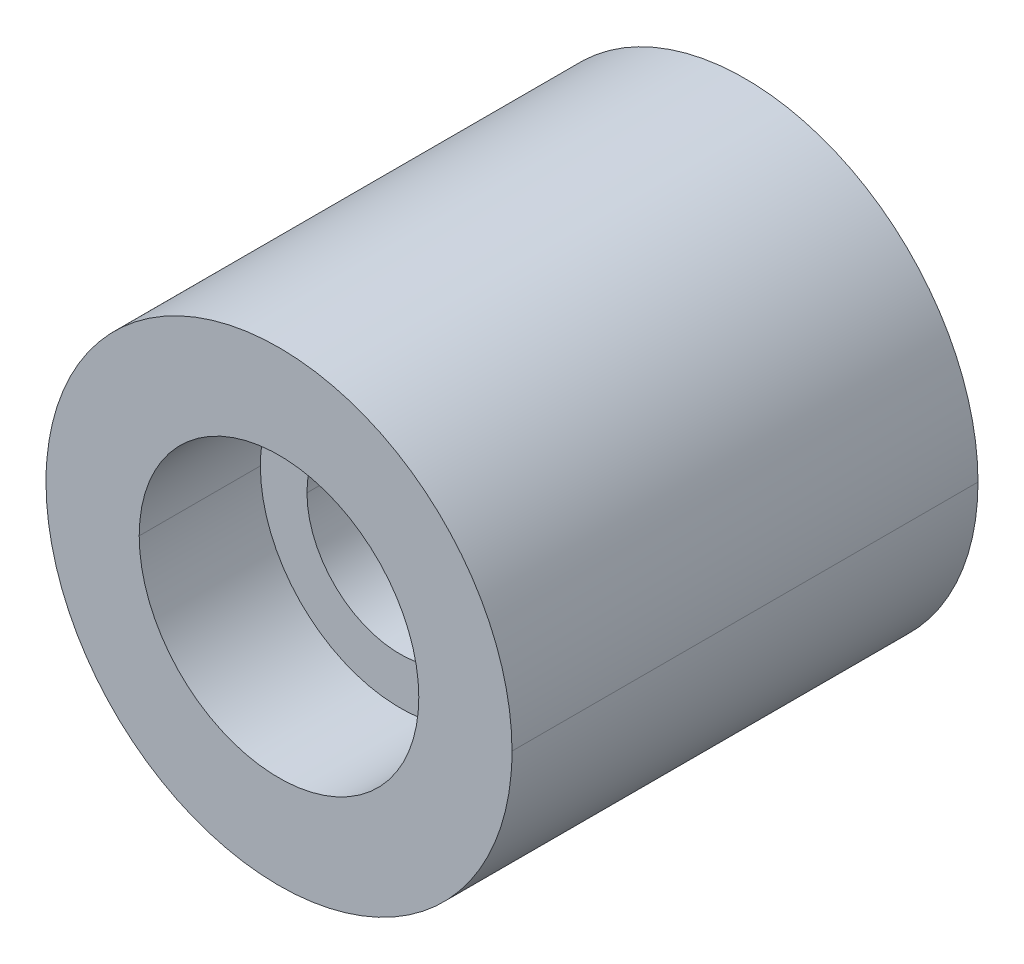
ISO-10303-21;
HEADER;
FILE_DESCRIPTION(('STEP AP214'),'2;1');
FILE_NAME('part.step','',(''),(''),'','','');
FILE_SCHEMA(('AUTOMOTIVE_DESIGN { 1 0 10303 214 1 1 1 1 }'));
ENDSEC;
DATA;
#1=APPLICATION_CONTEXT('core data for automotive mechanical design processes');
#2=APPLICATION_PROTOCOL_DEFINITION('international standard','automotive_design',2000,#1);
#3=PRODUCT_CONTEXT('',#1,'mechanical');
#4=PRODUCT('Part','Part','',(#3));
#5=PRODUCT_RELATED_PRODUCT_CATEGORY('part','',(#4));
#6=PRODUCT_DEFINITION_FORMATION('','',#4);
#7=PRODUCT_DEFINITION_CONTEXT('part definition',#1,'design');
#8=PRODUCT_DEFINITION('design','',#6,#7);
#9=PRODUCT_DEFINITION_SHAPE('','',#8);
#10=(LENGTH_UNIT() NAMED_UNIT(*) SI_UNIT(.MILLI.,.METRE.));
#11=(NAMED_UNIT(*) PLANE_ANGLE_UNIT() SI_UNIT($,.RADIAN.));
#12=(NAMED_UNIT(*) SI_UNIT($,.STERADIAN.) SOLID_ANGLE_UNIT());
#13=UNCERTAINTY_MEASURE_WITH_UNIT(LENGTH_MEASURE(1.E-05),#10,'distance_accuracy_value','');
#14=(GEOMETRIC_REPRESENTATION_CONTEXT(3) GLOBAL_UNCERTAINTY_ASSIGNED_CONTEXT((#13)) GLOBAL_UNIT_ASSIGNED_CONTEXT((#10,
#11,#12)) REPRESENTATION_CONTEXT('',''));
#15=CARTESIAN_POINT('',(0.,0.,0.));
#16=DIRECTION('',(0.,0.,1.));
#17=DIRECTION('',(1.,0.,0.));
#18=AXIS2_PLACEMENT_3D('',#15,#16,#17);
#19=CARTESIAN_POINT('',(-2.5,0.,-5.));
#20=DIRECTION('',(0.,0.,1.));
#21=DIRECTION('',(1.,0.,0.));
#22=AXIS2_PLACEMENT_3D('',#19,#20,#21);
#23=PLANE('',#22);
#24=CARTESIAN_POINT('',(0.,0.,-5.));
#25=DIRECTION('',(0.,0.,1.));
#26=DIRECTION('',(1.,0.,0.));
#27=AXIS2_PLACEMENT_3D('',#24,#25,#26);
#28=CIRCLE('',#27,1.);
#29=CARTESIAN_POINT('',(1.,0.,-5.));
#30=VERTEX_POINT('',#29);
#31=CARTESIAN_POINT('',(-1.,0.,-5.));
#32=VERTEX_POINT('',#31);
#33=EDGE_CURVE('E106',#30,#32,#28,.T.);
#34=ORIENTED_EDGE('',*,*,#33,.T.);
#35=CARTESIAN_POINT('',(0.,0.,-5.));
#36=DIRECTION('',(0.,0.,1.));
#37=DIRECTION('',(1.,0.,0.));
#38=AXIS2_PLACEMENT_3D('',#35,#36,#37);
#39=CIRCLE('',#38,1.);
#40=EDGE_CURVE('E103',#32,#30,#39,.T.);
#41=ORIENTED_EDGE('',*,*,#40,.T.);
#42=EDGE_LOOP('',(#34,#41));
#43=FACE_BOUND('',#42,.T.);
#44=CARTESIAN_POINT('',(0.,0.,-5.));
#45=DIRECTION('',(0.,0.,1.));
#46=DIRECTION('',(1.,0.,0.));
#47=AXIS2_PLACEMENT_3D('',#44,#45,#46);
#48=CIRCLE('',#47,2.5);
#49=CARTESIAN_POINT('',(2.5,0.,-5.));
#50=VERTEX_POINT('',#49);
#51=CARTESIAN_POINT('',(-2.5,0.,-5.));
#52=VERTEX_POINT('',#51);
#53=EDGE_CURVE('E111',#50,#52,#48,.T.);
#54=ORIENTED_EDGE('',*,*,#53,.F.);
#55=CARTESIAN_POINT('',(0.,0.,-5.));
#56=DIRECTION('',(0.,0.,1.));
#57=DIRECTION('',(1.,0.,0.));
#58=AXIS2_PLACEMENT_3D('',#55,#56,#57);
#59=CIRCLE('',#58,2.5);
#60=EDGE_CURVE('E11',#52,#50,#59,.T.);
#61=ORIENTED_EDGE('',*,*,#60,.F.);
#62=EDGE_LOOP('',(#54,#61));
#63=FACE_BOUND('',#62,.T.);
#64=ADVANCED_FACE('F17',(#43,#63),#23,.F.);
#65=CARTESIAN_POINT('',(0.,0.,0.));
#66=DIRECTION('',(0.,0.,1.));
#67=DIRECTION('',(1.,0.,0.));
#68=AXIS2_PLACEMENT_3D('',#65,#66,#67);
#69=CYLINDRICAL_SURFACE('',#68,2.5);
#70=DIRECTION('',(0.,0.,1.));
#71=VECTOR('',#70,1.);
#72=CARTESIAN_POINT('',(-2.5,0.,0.));
#73=LINE('',#72,#71);
#74=CARTESIAN_POINT('',(-2.5,0.,0.));
#75=VERTEX_POINT('',#74);
#76=EDGE_CURVE('E181',#52,#75,#73,.T.);
#77=ORIENTED_EDGE('',*,*,#76,.F.);
#78=ORIENTED_EDGE('',*,*,#60,.T.);
#79=DIRECTION('',(0.,0.,1.));
#80=VECTOR('',#79,1.);
#81=CARTESIAN_POINT('',(2.5,0.,0.));
#82=LINE('',#81,#80);
#83=CARTESIAN_POINT('',(2.5,0.,0.));
#84=VERTEX_POINT('',#83);
#85=EDGE_CURVE('E28',#50,#84,#82,.T.);
#86=ORIENTED_EDGE('',*,*,#85,.T.);
#87=CARTESIAN_POINT('',(-2.5,0.,0.));
#88=CARTESIAN_POINT('',(-2.5,-0.232376993469,0.));
#89=CARTESIAN_POINT('',(-2.47300046646,-0.464753605108,0.));
#90=CARTESIAN_POINT('',(-2.41899536913,-0.692956947242,0.));
#91=CARTESIAN_POINT('',(-2.25896066501,-1.13261792039,0.));
#92=CARTESIAN_POINT('',(-2.00238386705,-1.52387206404,0.));
#93=CARTESIAN_POINT('',(-1.85182487192,-1.70366445395,0.));
#94=CARTESIAN_POINT('',(-1.51170614134,-2.02496201984,0.));
#95=CARTESIAN_POINT('',(-1.10698178651,-2.25971647378,0.));
#96=CARTESIAN_POINT('',(-0.891808454339,-2.35295678054,0.));
#97=CARTESIAN_POINT('',(-0.443758447734,-2.48773091022,0.));
#98=CARTESIAN_POINT('',(0.0232552840508,-2.51618489225,0.));
#99=CARTESIAN_POINT('',(0.257396106103,-2.50309312107,0.));
#100=CARTESIAN_POINT('',(0.718328113524,-2.42275284772,0.));
#101=CARTESIAN_POINT('',(1.14855898515,-2.23887013383,0.));
#102=CARTESIAN_POINT('',(1.35199668373,-2.12222357361,0.));
#103=CARTESIAN_POINT('',(1.72802863007,-1.84381227246,0.));
#104=CARTESIAN_POINT('',(2.03020751425,-1.48660171889,0.));
#105=CARTESIAN_POINT('',(2.15978483864,-1.29114576084,0.));
#106=CARTESIAN_POINT('',(2.34574356163,-0.923892079527,0.));
#107=CARTESIAN_POINT('',(2.4532587915,-0.527734590024,0.));
#108=CARTESIAN_POINT('',(2.48442002643,-0.353043827519,0.));
#109=CARTESIAN_POINT('',(2.5,-0.176521803592,0.));
#110=CARTESIAN_POINT('',(2.5,0.,0.));
#111=(BOUNDED_CURVE() B_SPLINE_CURVE(5,(#87,#88,#89,#90,#91,#92,#93,#94,#95,#96,#97,#98,#99,
#100,#101,#102,#103,#104,#105,#106,#107,#108,#109,#110),.UNSPECIFIED.,.F.,
.F.) B_SPLINE_CURVE_WITH_KNOTS((6,3,3,3,3,3,3,6),(0.,1.64315347874,3.2863069603,4.92946043079,
6.57261389546,8.21576737015,9.85892085167,11.1071184951),
.UNSPECIFIED.) CURVE() GEOMETRIC_REPRESENTATION_ITEM() RATIONAL_B_SPLINE_CURVE((1.,1.,1.,1.,1.,
1.,1.,1.,1.,1.,1.,1.,1.,1.,1.,1.,1.,1.,1.,1.,1.,1.,1.,1.)) REPRESENTATION_ITEM(''));
#112=EDGE_CURVE('E132',#75,#84,#111,.T.);
#113=ORIENTED_EDGE('',*,*,#112,.F.);
#114=EDGE_LOOP('',(#77,#78,#86,#113));
#115=FACE_BOUND('',#114,.T.);
#116=ADVANCED_FACE('F264',(#115),#69,.T.);
#117=CARTESIAN_POINT('',(0.,0.,0.));
#118=DIRECTION('',(0.,0.,1.));
#119=DIRECTION('',(1.,0.,0.));
#120=AXIS2_PLACEMENT_3D('',#117,#118,#119);
#121=CYLINDRICAL_SURFACE('',#120,2.5);
#122=ORIENTED_EDGE('',*,*,#53,.T.);
#123=ORIENTED_EDGE('',*,*,#76,.T.);
#124=CARTESIAN_POINT('',(2.5,0.,0.));
#125=CARTESIAN_POINT('',(2.5,0.23237699347,0.));
#126=CARTESIAN_POINT('',(2.47300046646,0.464753605108,0.));
#127=CARTESIAN_POINT('',(2.41899536913,0.692956947241,0.));
#128=CARTESIAN_POINT('',(2.25896066501,1.13261792039,0.));
#129=CARTESIAN_POINT('',(2.00238386705,1.52387206404,0.));
#130=CARTESIAN_POINT('',(1.85182487192,1.70366445395,0.));
#131=CARTESIAN_POINT('',(1.51170614134,2.02496201984,0.));
#132=CARTESIAN_POINT('',(1.10698178651,2.25971647378,0.));
#133=CARTESIAN_POINT('',(0.891808454339,2.35295678054,0.));
#134=CARTESIAN_POINT('',(0.443758447735,2.48773091022,0.));
#135=CARTESIAN_POINT('',(-0.0232552840495,2.51618489225,0.));
#136=CARTESIAN_POINT('',(-0.257396106105,2.50309312107,0.));
#137=CARTESIAN_POINT('',(-0.718328113523,2.42275284771,0.));
#138=CARTESIAN_POINT('',(-1.14855898514,2.23887013383,0.));
#139=CARTESIAN_POINT('',(-1.35199668374,2.12222357361,0.));
#140=CARTESIAN_POINT('',(-1.72802863007,1.84381227246,0.));
#141=CARTESIAN_POINT('',(-2.03020751425,1.48660171889,0.));
#142=CARTESIAN_POINT('',(-2.15978483864,1.29114576084,0.));
#143=CARTESIAN_POINT('',(-2.34574356163,0.923892079526,0.));
#144=CARTESIAN_POINT('',(-2.4532587915,0.527734590023,0.));
#145=CARTESIAN_POINT('',(-2.48442002643,0.35304382752,0.));
#146=CARTESIAN_POINT('',(-2.5,0.176521803593,0.));
#147=CARTESIAN_POINT('',(-2.5,0.,0.));
#148=(BOUNDED_CURVE() B_SPLINE_CURVE(5,(#124,#125,#126,#127,#128,#129,#130,#131,#132,#133,#134,
#135,#136,#137,#138,#139,#140,#141,#142,#143,#144,#145,#146,#147),.UNSPECIFIED.,.F.,
.F.) B_SPLINE_CURVE_WITH_KNOTS((6,3,3,3,3,3,3,6),(0.,1.64315347874,3.28630696031,4.9294604308,
6.57261389546,8.21576737014,9.85892085166,11.1071184951),
.UNSPECIFIED.) CURVE() GEOMETRIC_REPRESENTATION_ITEM() RATIONAL_B_SPLINE_CURVE((1.,1.,1.,1.,1.,
1.,1.,1.,1.,1.,1.,1.,1.,1.,1.,1.,1.,1.,1.,1.,1.,1.,1.,1.)) REPRESENTATION_ITEM(''));
#149=EDGE_CURVE('E161',#84,#75,#148,.T.);
#150=ORIENTED_EDGE('',*,*,#149,.F.);
#151=ORIENTED_EDGE('',*,*,#85,.F.);
#152=EDGE_LOOP('',(#122,#123,#150,#151));
#153=FACE_BOUND('',#152,.T.);
#154=ADVANCED_FACE('F262',(#153),#121,.T.);
#155=CARTESIAN_POINT('',(0.,0.,0.));
#156=DIRECTION('',(0.,0.,1.));
#157=DIRECTION('',(1.,0.,0.));
#158=AXIS2_PLACEMENT_3D('',#155,#156,#157);
#159=CYLINDRICAL_SURFACE('',#158,1.);
#160=ORIENTED_EDGE('',*,*,#40,.F.);
#161=DIRECTION('',(0.,0.,1.));
#162=VECTOR('',#161,1.);
#163=CARTESIAN_POINT('',(-1.,0.,0.));
#164=LINE('',#163,#162);
#165=CARTESIAN_POINT('',(-1.,0.,-4.5));
#166=VERTEX_POINT('',#165);
#167=EDGE_CURVE('E125',#32,#166,#164,.T.);
#168=ORIENTED_EDGE('',*,*,#167,.T.);
#169=CARTESIAN_POINT('',(-1.,0.,-4.5));
#170=CARTESIAN_POINT('',(-1.,-0.0979785568149,-4.5));
#171=CARTESIAN_POINT('',(-0.988000253016,-0.195956689375,-4.5));
#172=CARTESIAN_POINT('',(-0.963997580109,-0.29198034652,-4.5));
#173=CARTESIAN_POINT('',(-0.892969030651,-0.476182526371,-4.5));
#174=CARTESIAN_POINT('',(-0.779587891189,-0.637797965008,-4.5));
#175=CARTESIAN_POINT('',(-0.713225814277,-0.711233291885,-4.5));
#176=CARTESIAN_POINT('',(-0.563877854178,-0.840348293241,-4.5));
#177=CARTESIAN_POINT('',(-0.387786650424,-0.929604775489,-4.5));
#178=CARTESIAN_POINT('',(-0.294676065443,-0.963176969096,-4.5));
#179=CARTESIAN_POINT('',(-0.10214104395,-1.00683200961,-4.5));
#180=CARTESIAN_POINT('',(0.0952368426436,-1.00273299981,-4.5));
#181=CARTESIAN_POINT('',(0.193192755745,-0.98854459464,-4.5));
#182=CARTESIAN_POINT('',(0.38362324251,-0.936470338779,-4.5));
#183=CARTESIAN_POINT('',(0.555856987942,-0.839980078754,-4.5));
#184=CARTESIAN_POINT('',(0.635615255516,-0.78136873771,-4.5));
#185=CARTESIAN_POINT('',(0.779144673579,-0.645815039948,-4.5));
#186=CARTESIAN_POINT('',(0.885718312667,-0.479631727956,-4.5));
#187=CARTESIAN_POINT('',(0.928516747925,-0.390385074428,-4.5));
#188=CARTESIAN_POINT('',(0.972911898439,-0.25822255235,-4.5));
#189=CARTESIAN_POINT('',(0.993856533221,-0.121253382943,-4.5));
#190=CARTESIAN_POINT('',(0.997959135699,-0.0808132256003,-4.5));
#191=CARTESIAN_POINT('',(1.,-0.0404065767224,-4.5));
#192=CARTESIAN_POINT('',(1.,0.,-4.5));
#193=(BOUNDED_CURVE() B_SPLINE_CURVE(5,(#169,#170,#171,#172,#173,#174,#175,#176,#177,#178,#179,
#180,#181,#182,#183,#184,#185,#186,#187,#188,#189,#190,#191,#192),.UNSPECIFIED.,.F.,
.F.) B_SPLINE_CURVE_WITH_KNOTS((6,3,3,3,3,3,3,6),(0.,0.692813019347,1.38562602559,2.07843902508,
2.77125203691,3.46406506001,4.15687807886,4.44259572291),
.UNSPECIFIED.) CURVE() GEOMETRIC_REPRESENTATION_ITEM() RATIONAL_B_SPLINE_CURVE((1.,1.,1.,1.,1.,
1.,1.,1.,1.,1.,1.,1.,1.,1.,1.,1.,1.,1.,1.,1.,1.,1.,1.,1.)) REPRESENTATION_ITEM(''));
#194=CARTESIAN_POINT('',(1.,0.,-4.5));
#195=VERTEX_POINT('',#194);
#196=EDGE_CURVE('E118',#166,#195,#193,.T.);
#197=ORIENTED_EDGE('',*,*,#196,.T.);
#198=DIRECTION('',(0.,0.,1.));
#199=VECTOR('',#198,1.);
#200=CARTESIAN_POINT('',(1.,0.,0.));
#201=LINE('',#200,#199);
#202=EDGE_CURVE('E112',#30,#195,#201,.T.);
#203=ORIENTED_EDGE('',*,*,#202,.F.);
#204=EDGE_LOOP('',(#160,#168,#197,#203));
#205=FACE_BOUND('',#204,.T.);
#206=ADVANCED_FACE('F116',(#205),#159,.F.);
#207=CARTESIAN_POINT('',(0.,0.,0.));
#208=DIRECTION('',(0.,0.,1.));
#209=DIRECTION('',(1.,0.,0.));
#210=AXIS2_PLACEMENT_3D('',#207,#208,#209);
#211=CYLINDRICAL_SURFACE('',#210,1.);
#212=ORIENTED_EDGE('',*,*,#167,.F.);
#213=ORIENTED_EDGE('',*,*,#33,.F.);
#214=ORIENTED_EDGE('',*,*,#202,.T.);
#215=CARTESIAN_POINT('',(1.,0.,-4.5));
#216=CARTESIAN_POINT('',(1.,0.0979785568148,-4.5));
#217=CARTESIAN_POINT('',(0.988000253016,0.195956689375,-4.5));
#218=CARTESIAN_POINT('',(0.963997580109,0.29198034652,-4.5));
#219=CARTESIAN_POINT('',(0.892969030651,0.476182526371,-4.5));
#220=CARTESIAN_POINT('',(0.779587891188,0.637797965008,-4.5));
#221=CARTESIAN_POINT('',(0.713225814277,0.711233291885,-4.5));
#222=CARTESIAN_POINT('',(0.563877854178,0.840348293241,-4.5));
#223=CARTESIAN_POINT('',(0.387786650424,0.929604775489,-4.5));
#224=CARTESIAN_POINT('',(0.294676065443,0.963176969096,-4.5));
#225=CARTESIAN_POINT('',(0.10214104395,1.00683200961,-4.5));
#226=CARTESIAN_POINT('',(-0.0952368426438,1.00273299981,-4.5));
#227=CARTESIAN_POINT('',(-0.193192755745,0.98854459464,-4.5));
#228=CARTESIAN_POINT('',(-0.38362324251,0.936470338779,-4.5));
#229=CARTESIAN_POINT('',(-0.555856987942,0.839980078754,-4.5));
#230=CARTESIAN_POINT('',(-0.635615255516,0.78136873771,-4.5));
#231=CARTESIAN_POINT('',(-0.779144673579,0.645815039949,-4.5));
#232=CARTESIAN_POINT('',(-0.885718312666,0.479631727957,-4.5));
#233=CARTESIAN_POINT('',(-0.928516747925,0.390385074428,-4.5));
#234=CARTESIAN_POINT('',(-0.972911898439,0.25822255235,-4.5));
#235=CARTESIAN_POINT('',(-0.993856533221,0.121253382943,-4.5));
#236=CARTESIAN_POINT('',(-0.997959135699,0.0808132256003,-4.5));
#237=CARTESIAN_POINT('',(-1.,0.0404065767224,-4.5));
#238=CARTESIAN_POINT('',(-1.,0.,-4.5));
#239=(BOUNDED_CURVE() B_SPLINE_CURVE(5,(#215,#216,#217,#218,#219,#220,#221,#222,#223,#224,#225,
#226,#227,#228,#229,#230,#231,#232,#233,#234,#235,#236,#237,#238),.UNSPECIFIED.,.F.,
.F.) B_SPLINE_CURVE_WITH_KNOTS((6,3,3,3,3,3,3,6),(0.,0.692813019346,1.38562602559,2.07843902508,
2.77125203691,3.46406506001,4.15687807886,4.44259572291),
.UNSPECIFIED.) CURVE() GEOMETRIC_REPRESENTATION_ITEM() RATIONAL_B_SPLINE_CURVE((1.,1.,1.,1.,1.,
1.,1.,1.,1.,1.,1.,1.,1.,1.,1.,1.,1.,1.,1.,1.,1.,1.,1.,1.)) REPRESENTATION_ITEM(''));
#240=EDGE_CURVE('E151',#195,#166,#239,.T.);
#241=ORIENTED_EDGE('',*,*,#240,.T.);
#242=EDGE_LOOP('',(#212,#213,#214,#241));
#243=FACE_BOUND('',#242,.T.);
#244=ADVANCED_FACE('F124',(#243),#211,.F.);
#245=CARTESIAN_POINT('',(-1.5,0.,0.));
#246=DIRECTION('',(0.,0.,-1.));
#247=DIRECTION('',(0.,-1.,0.));
#248=AXIS2_PLACEMENT_3D('',#245,#246,#247);
#249=PLANE('',#248);
#250=CARTESIAN_POINT('',(0.,0.,0.));
#251=DIRECTION('',(0.,0.,1.));
#252=DIRECTION('',(1.,0.,0.));
#253=AXIS2_PLACEMENT_3D('',#250,#251,#252);
#254=CIRCLE('',#253,1.5);
#255=CARTESIAN_POINT('',(1.5,0.,0.));
#256=VERTEX_POINT('',#255);
#257=CARTESIAN_POINT('',(-1.5,0.,0.));
#258=VERTEX_POINT('',#257);
#259=EDGE_CURVE('E152',#256,#258,#254,.T.);
#260=ORIENTED_EDGE('',*,*,#259,.F.);
#261=CARTESIAN_POINT('',(0.,0.,0.));
#262=DIRECTION('',(0.,0.,1.));
#263=DIRECTION('',(1.,0.,0.));
#264=AXIS2_PLACEMENT_3D('',#261,#262,#263);
#265=CIRCLE('',#264,1.5);
#266=EDGE_CURVE('E148',#258,#256,#265,.T.);
#267=ORIENTED_EDGE('',*,*,#266,.F.);
#268=EDGE_LOOP('',(#260,#267));
#269=FACE_BOUND('',#268,.T.);
#270=ORIENTED_EDGE('',*,*,#149,.T.);
#271=ORIENTED_EDGE('',*,*,#112,.T.);
#272=EDGE_LOOP('',(#270,#271));
#273=FACE_BOUND('',#272,.T.);
#274=ADVANCED_FACE('F211',(#269,#273),#249,.F.);
#275=CARTESIAN_POINT('',(-2.,0.,-4.5));
#276=DIRECTION('',(0.,0.,-1.));
#277=DIRECTION('',(0.,-1.,0.));
#278=AXIS2_PLACEMENT_3D('',#275,#276,#277);
#279=PLANE('',#278);
#280=ORIENTED_EDGE('',*,*,#240,.F.);
#281=ORIENTED_EDGE('',*,*,#196,.F.);
#282=EDGE_LOOP('',(#280,#281));
#283=FACE_BOUND('',#282,.T.);
#284=CARTESIAN_POINT('',(0.,0.,-4.5));
#285=DIRECTION('',(0.,0.,1.));
#286=DIRECTION('',(1.,0.,0.));
#287=AXIS2_PLACEMENT_3D('',#284,#285,#286);
#288=CIRCLE('',#287,2.);
#289=CARTESIAN_POINT('',(2.,0.,-4.5));
#290=VERTEX_POINT('',#289);
#291=CARTESIAN_POINT('',(-2.,0.,-4.5));
#292=VERTEX_POINT('',#291);
#293=EDGE_CURVE('E136',#290,#292,#288,.T.);
#294=ORIENTED_EDGE('',*,*,#293,.T.);
#295=CARTESIAN_POINT('',(0.,0.,-4.5));
#296=DIRECTION('',(0.,0.,1.));
#297=DIRECTION('',(1.,0.,0.));
#298=AXIS2_PLACEMENT_3D('',#295,#296,#297);
#299=CIRCLE('',#298,2.);
#300=EDGE_CURVE('E177',#292,#290,#299,.T.);
#301=ORIENTED_EDGE('',*,*,#300,.T.);
#302=EDGE_LOOP('',(#294,#301));
#303=FACE_BOUND('',#302,.T.);
#304=ADVANCED_FACE('F209',(#283,#303),#279,.F.);
#305=CARTESIAN_POINT('',(0.,0.,0.));
#306=DIRECTION('',(0.,0.,1.));
#307=DIRECTION('',(1.,0.,0.));
#308=AXIS2_PLACEMENT_3D('',#305,#306,#307);
#309=CYLINDRICAL_SURFACE('',#308,1.5);
#310=CARTESIAN_POINT('',(-1.5,0.,-1.3));
#311=CARTESIAN_POINT('',(-1.5,-0.179995917201,-1.3));
#312=CARTESIAN_POINT('',(-1.47300122484,-0.359991198035,-1.3));
#313=CARTESIAN_POINT('',(-1.41898740997,-0.534604446808,-1.3));
#314=CARTESIAN_POINT('',(-1.2602861125,-0.86220889056,-1.3));
#315=CARTESIAN_POINT('',(-1.012454049,-1.12883261235,-1.3));
#316=CARTESIAN_POINT('',(-0.869280471064,-1.24244865057,-1.3));
#317=CARTESIAN_POINT('',(-0.553319256953,-1.42322277154,-1.3));
#318=CARTESIAN_POINT('',(-0.198227553453,-1.50334031601,-1.3));
#319=CARTESIAN_POINT('',(-0.0159088455457,-1.51626979686,-1.3));
#320=CARTESIAN_POINT('',(0.346937938243,-1.48706399517,-1.3));
#321=CARTESIAN_POINT('',(0.685245531009,-1.35268800301,-1.3));
#322=CARTESIAN_POINT('',(0.843020194458,-1.26041427264,-1.3));
#323=CARTESIAN_POINT('',(1.12599973072,-1.03143097888,-1.3));
#324=CARTESIAN_POINT('',(1.32934264252,-0.729502851114,-1.3));
#325=CARTESIAN_POINT('',(1.40745802191,-0.564259783279,-1.3));
#326=CARTESIAN_POINT('',(1.47188483428,-0.348738098805,-1.3));
#327=CARTESIAN_POINT('',(1.49548532329,-0.127397744905,-1.3));
#328=CARTESIAN_POINT('',(1.49849761926,-0.0849201598401,-1.3));
#329=CARTESIAN_POINT('',(1.5,-0.0424600622143,-1.3));
#330=CARTESIAN_POINT('',(1.5,0.,-1.3));
#331=(BOUNDED_CURVE() B_SPLINE_CURVE(5,(#310,#311,#312,#313,#314,#315,#316,#317,#318,#319,#320,
#321,#322,#323,#324,#325,#326,#327,#328,#329,#330),.UNSPECIFIED.,.F.,
.F.) B_SPLINE_CURVE_WITH_KNOTS((6,3,3,3,3,3,6),(0.,1.27276333639,2.54552668005,3.81828999931,
5.09105330297,6.3638166172,6.66405459642),
.UNSPECIFIED.) CURVE() GEOMETRIC_REPRESENTATION_ITEM() RATIONAL_B_SPLINE_CURVE((1.,1.,1.,1.,1.,
1.,1.,1.,1.,1.,1.,1.,1.,1.,1.,1.,1.,1.,1.,1.,1.)) REPRESENTATION_ITEM(''));
#332=CARTESIAN_POINT('',(-1.5,0.,-1.30000000075));
#333=VERTEX_POINT('',#332);
#334=CARTESIAN_POINT('',(1.5,0.,-1.30000000075));
#335=VERTEX_POINT('',#334);
#336=EDGE_CURVE('E142',#333,#335,#331,.T.);
#337=ORIENTED_EDGE('',*,*,#336,.F.);
#338=DIRECTION('',(0.,0.,1.));
#339=VECTOR('',#338,1.);
#340=CARTESIAN_POINT('',(-1.5,0.,0.));
#341=LINE('',#340,#339);
#342=EDGE_CURVE('E170',#333,#258,#341,.T.);
#343=ORIENTED_EDGE('',*,*,#342,.T.);
#344=ORIENTED_EDGE('',*,*,#266,.T.);
#345=DIRECTION('',(0.,0.,1.));
#346=VECTOR('',#345,1.);
#347=CARTESIAN_POINT('',(1.5,0.,0.));
#348=LINE('',#347,#346);
#349=EDGE_CURVE('E156',#335,#256,#348,.T.);
#350=ORIENTED_EDGE('',*,*,#349,.F.);
#351=EDGE_LOOP('',(#337,#343,#344,#350));
#352=FACE_BOUND('',#351,.T.);
#353=ADVANCED_FACE('F260',(#352),#309,.F.);
#354=CARTESIAN_POINT('',(0.,0.,0.));
#355=DIRECTION('',(0.,0.,1.));
#356=DIRECTION('',(1.,0.,0.));
#357=AXIS2_PLACEMENT_3D('',#354,#355,#356);
#358=CYLINDRICAL_SURFACE('',#357,1.5);
#359=ORIENTED_EDGE('',*,*,#342,.F.);
#360=CARTESIAN_POINT('',(1.5,0.,-1.3));
#361=CARTESIAN_POINT('',(1.5,0.179995917201,-1.3));
#362=CARTESIAN_POINT('',(1.47300122484,0.359991198035,-1.3));
#363=CARTESIAN_POINT('',(1.41898740997,0.534604446808,-1.3));
#364=CARTESIAN_POINT('',(1.2602861125,0.86220889056,-1.3));
#365=CARTESIAN_POINT('',(1.012454049,1.12883261235,-1.3));
#366=CARTESIAN_POINT('',(0.869280471064,1.24244865057,-1.3));
#367=CARTESIAN_POINT('',(0.553319256952,1.42322277154,-1.3));
#368=CARTESIAN_POINT('',(0.198227553451,1.50334031601,-1.3));
#369=CARTESIAN_POINT('',(0.0159088455474,1.51626979686,-1.3));
#370=CARTESIAN_POINT('',(-0.346937938243,1.48706399517,-1.3));
#371=CARTESIAN_POINT('',(-0.685245531009,1.35268800301,-1.3));
#372=CARTESIAN_POINT('',(-0.843020194457,1.26041427264,-1.3));
#373=CARTESIAN_POINT('',(-1.12599973072,1.03143097888,-1.3));
#374=CARTESIAN_POINT('',(-1.32934264252,0.729502851115,-1.3));
#375=CARTESIAN_POINT('',(-1.40745802191,0.564259783278,-1.3));
#376=CARTESIAN_POINT('',(-1.47188483428,0.348738098805,-1.3));
#377=CARTESIAN_POINT('',(-1.49548532329,0.127397744905,-1.3));
#378=CARTESIAN_POINT('',(-1.49849761926,0.0849201598401,-1.3));
#379=CARTESIAN_POINT('',(-1.5,0.0424600622143,-1.3));
#380=CARTESIAN_POINT('',(-1.5,0.,-1.3));
#381=(BOUNDED_CURVE() B_SPLINE_CURVE(5,(#360,#361,#362,#363,#364,#365,#366,#367,#368,#369,#370,
#371,#372,#373,#374,#375,#376,#377,#378,#379,#380),.UNSPECIFIED.,.F.,
.F.) B_SPLINE_CURVE_WITH_KNOTS((6,3,3,3,3,3,6),(0.,1.27276333639,2.54552668004,3.81828999931,
5.09105330297,6.3638166172,6.66405459642),
.UNSPECIFIED.) CURVE() GEOMETRIC_REPRESENTATION_ITEM() RATIONAL_B_SPLINE_CURVE((1.,1.,1.,1.,1.,
1.,1.,1.,1.,1.,1.,1.,1.,1.,1.,1.,1.,1.,1.,1.,1.)) REPRESENTATION_ITEM(''));
#382=EDGE_CURVE('E138',#335,#333,#381,.T.);
#383=ORIENTED_EDGE('',*,*,#382,.F.);
#384=ORIENTED_EDGE('',*,*,#349,.T.);
#385=ORIENTED_EDGE('',*,*,#259,.T.);
#386=EDGE_LOOP('',(#359,#383,#384,#385));
#387=FACE_BOUND('',#386,.T.);
#388=ADVANCED_FACE('F317',(#387),#358,.F.);
#389=CARTESIAN_POINT('',(0.,0.,0.));
#390=DIRECTION('',(0.,0.,1.));
#391=DIRECTION('',(1.,0.,0.));
#392=AXIS2_PLACEMENT_3D('',#389,#390,#391);
#393=CYLINDRICAL_SURFACE('',#392,2.);
#394=ORIENTED_EDGE('',*,*,#300,.F.);
#395=DIRECTION('',(0.,0.,1.));
#396=VECTOR('',#395,1.);
#397=CARTESIAN_POINT('',(-2.,0.,0.));
#398=LINE('',#397,#396);
#399=CARTESIAN_POINT('',(-2.,0.,-1.8));
#400=VERTEX_POINT('',#399);
#401=EDGE_CURVE('E487',#292,#400,#398,.T.);
#402=ORIENTED_EDGE('',*,*,#401,.T.);
#403=CARTESIAN_POINT('',(0.,0.,-1.8));
#404=DIRECTION('',(0.,0.,1.));
#405=DIRECTION('',(1.,0.,0.));
#406=AXIS2_PLACEMENT_3D('',#403,#404,#405);
#407=CIRCLE('',#406,2.);
#408=CARTESIAN_POINT('',(2.,0.,-1.80000000075));
#409=VERTEX_POINT('',#408);
#410=EDGE_CURVE('E182',#400,#409,#407,.T.);
#411=ORIENTED_EDGE('',*,*,#410,.T.);
#412=DIRECTION('',(0.,0.,1.));
#413=VECTOR('',#412,1.);
#414=CARTESIAN_POINT('',(2.,0.,0.));
#415=LINE('',#414,#413);
#416=EDGE_CURVE('E503',#290,#409,#415,.T.);
#417=ORIENTED_EDGE('',*,*,#416,.F.);
#418=EDGE_LOOP('',(#394,#402,#411,#417));
#419=FACE_BOUND('',#418,.T.);
#420=ADVANCED_FACE('F19',(#419),#393,.F.);
#421=CARTESIAN_POINT('',(0.,0.,0.));
#422=DIRECTION('',(0.,0.,1.));
#423=DIRECTION('',(1.,0.,0.));
#424=AXIS2_PLACEMENT_3D('',#421,#422,#423);
#425=CYLINDRICAL_SURFACE('',#424,2.);
#426=ORIENTED_EDGE('',*,*,#401,.F.);
#427=ORIENTED_EDGE('',*,*,#293,.F.);
#428=ORIENTED_EDGE('',*,*,#416,.T.);
#429=CARTESIAN_POINT('',(0.,0.,-1.8));
#430=DIRECTION('',(0.,0.,1.));
#431=DIRECTION('',(1.,0.,0.));
#432=AXIS2_PLACEMENT_3D('',#429,#430,#431);
#433=CIRCLE('',#432,2.);
#434=EDGE_CURVE('E186',#409,#400,#433,.T.);
#435=ORIENTED_EDGE('',*,*,#434,.T.);
#436=EDGE_LOOP('',(#426,#427,#428,#435));
#437=FACE_BOUND('',#436,.T.);
#438=ADVANCED_FACE('F278',(#437),#425,.F.);
#439=CARTESIAN_POINT('',(-1.5,0.,-1.3));
#440=DIRECTION('',(0.,0.,-1.));
#441=DIRECTION('',(0.,-1.,0.));
#442=AXIS2_PLACEMENT_3D('',#439,#440,#441);
#443=PLANE('',#442);
#444=CARTESIAN_POINT('',(0.,0.,-1.30000000075));
#445=DIRECTION('',(0.,0.,1.));
#446=DIRECTION('',(1.,0.,0.));
#447=AXIS2_PLACEMENT_3D('',#444,#445,#446);
#448=CIRCLE('',#447,1.);
#449=CARTESIAN_POINT('',(1.,0.,-1.30000000075));
#450=VERTEX_POINT('',#449);
#451=CARTESIAN_POINT('',(-1.,0.,-1.3));
#452=VERTEX_POINT('',#451);
#453=EDGE_CURVE('E143',#450,#452,#448,.T.);
#454=ORIENTED_EDGE('',*,*,#453,.F.);
#455=CARTESIAN_POINT('',(0.,0.,-1.3));
#456=DIRECTION('',(0.,0.,1.));
#457=DIRECTION('',(-1.,0.,0.));
#458=AXIS2_PLACEMENT_3D('',#455,#456,#457);
#459=CIRCLE('',#458,1.);
#460=EDGE_CURVE('E192',#452,#450,#459,.T.);
#461=ORIENTED_EDGE('',*,*,#460,.F.);
#462=EDGE_LOOP('',(#454,#461));
#463=FACE_BOUND('',#462,.T.);
#464=ORIENTED_EDGE('',*,*,#382,.T.);
#465=ORIENTED_EDGE('',*,*,#336,.T.);
#466=EDGE_LOOP('',(#464,#465));
#467=FACE_BOUND('',#466,.T.);
#468=ADVANCED_FACE('F274',(#463,#467),#443,.F.);
#469=CARTESIAN_POINT('',(0.,0.,0.));
#470=DIRECTION('',(0.,0.,1.));
#471=DIRECTION('',(1.,0.,0.));
#472=AXIS2_PLACEMENT_3D('',#469,#470,#471);
#473=CYLINDRICAL_SURFACE('',#472,1.);
#474=DIRECTION('',(0.,0.,1.));
#475=VECTOR('',#474,1.);
#476=CARTESIAN_POINT('',(-1.,0.,0.));
#477=LINE('',#476,#475);
#478=CARTESIAN_POINT('',(-1.,0.,-1.80000000075));
#479=VERTEX_POINT('',#478);
#480=EDGE_CURVE('E236',#479,#452,#477,.T.);
#481=ORIENTED_EDGE('',*,*,#480,.F.);
#482=CARTESIAN_POINT('',(0.,0.,-1.8));
#483=DIRECTION('',(0.,0.,1.));
#484=DIRECTION('',(1.,0.,0.));
#485=AXIS2_PLACEMENT_3D('',#482,#483,#484);
#486=CIRCLE('',#485,1.);
#487=CARTESIAN_POINT('',(1.,0.,-1.8));
#488=VERTEX_POINT('',#487);
#489=EDGE_CURVE('E66',#488,#479,#486,.T.);
#490=ORIENTED_EDGE('',*,*,#489,.F.);
#491=DIRECTION('',(0.,0.,1.));
#492=VECTOR('',#491,1.);
#493=CARTESIAN_POINT('',(1.,0.,0.));
#494=LINE('',#493,#492);
#495=EDGE_CURVE('E242',#488,#450,#494,.T.);
#496=ORIENTED_EDGE('',*,*,#495,.T.);
#497=ORIENTED_EDGE('',*,*,#453,.T.);
#498=EDGE_LOOP('',(#481,#490,#496,#497));
#499=FACE_BOUND('',#498,.T.);
#500=ADVANCED_FACE('F259',(#499),#473,.F.);
#501=CARTESIAN_POINT('',(-2.,0.,-1.8));
#502=DIRECTION('',(0.,0.,1.));
#503=DIRECTION('',(1.,0.,0.));
#504=AXIS2_PLACEMENT_3D('',#501,#502,#503);
#505=PLANE('',#504);
#506=ORIENTED_EDGE('',*,*,#489,.T.);
#507=CARTESIAN_POINT('',(-1.,0.,-1.8));
#508=CARTESIAN_POINT('',(-1.,-0.198634691642765,-1.8));
#509=CARTESIAN_POINT('',(-0.92378041200315,-0.382594922668909,-1.8));
#510=CARTESIAN_POINT('',(-0.847914141245038,-0.565702402813397,-1.8));
#511=CARTESIAN_POINT('',(-0.706883783869844,-0.706883783869469,-1.8));
#512=CARTESIAN_POINT('',(-0.56661241254926,-0.847305366103595,-1.8));
#513=CARTESIAN_POINT('',(-0.38259492266894,-0.923780412001884,-1.8));
#514=CARTESIAN_POINT('',(-0.199449738393835,-0.999892940124066,-1.8));
#515=CARTESIAN_POINT('',(0.,-0.999999999997999,-1.8));
#516=CARTESIAN_POINT('',(0.19837768554711,-1.00010648441947,-1.8));
#517=CARTESIAN_POINT('',(0.38259492266894,-0.923780412001884,-1.8));
#518=CARTESIAN_POINT('',(0.56570240281333,-0.84791414124428,-1.8));
#519=CARTESIAN_POINT('',(0.706883783869845,-0.706883783869469,-1.8));
#520=CARTESIAN_POINT('',(0.84730536610431,-0.566612412549369,-1.8));
#521=CARTESIAN_POINT('',(0.92378041200315,-0.382594922668909,-1.8));
#522=CARTESIAN_POINT('',(1.,-0.199192126396565,-1.8));
#523=CARTESIAN_POINT('',(1.,0.,-1.8));
#524=B_SPLINE_CURVE_WITH_KNOTS('',2,(#507,#508,#509,#510,#511,#512,#513,#514,#515,#516,#517,
#518,#519,#520,#521,#522,#523),.UNSPECIFIED.,.F.,.F.,(3,2,2,2,2,2,2,2,3),(0.,0.125,0.25,0.375,
0.5,0.625,0.75,0.875,1.),.UNSPECIFIED.);
#525=EDGE_CURVE('E239',#479,#488,#524,.T.);
#526=ORIENTED_EDGE('',*,*,#525,.T.);
#527=EDGE_LOOP('',(#506,#526));
#528=FACE_BOUND('',#527,.T.);
#529=ORIENTED_EDGE('',*,*,#434,.F.);
#530=ORIENTED_EDGE('',*,*,#410,.F.);
#531=EDGE_LOOP('',(#529,#530));
#532=FACE_BOUND('',#531,.T.);
#533=ADVANCED_FACE('F208',(#528,#532),#505,.F.);
#534=CARTESIAN_POINT('',(0.,0.,0.));
#535=DIRECTION('',(0.,0.,1.));
#536=DIRECTION('',(1.,0.,0.));
#537=AXIS2_PLACEMENT_3D('',#534,#535,#536);
#538=CYLINDRICAL_SURFACE('',#537,1.);
#539=ORIENTED_EDGE('',*,*,#525,.F.);
#540=ORIENTED_EDGE('',*,*,#480,.T.);
#541=ORIENTED_EDGE('',*,*,#460,.T.);
#542=ORIENTED_EDGE('',*,*,#495,.F.);
#543=EDGE_LOOP('',(#539,#540,#541,#542));
#544=FACE_BOUND('',#543,.T.);
#545=ADVANCED_FACE('F198',(#544),#538,.F.);
#546=CLOSED_SHELL('',(#64,#116,#154,#206,#244,#274,#304,#353,#388,#420,#438,#468,#500,#533,#545));
#547=MANIFOLD_SOLID_BREP('B1',#546);
#548=ADVANCED_BREP_SHAPE_REPRESENTATION('',(#18,#547),#14);
#549=SHAPE_DEFINITION_REPRESENTATION(#9,#548);
ENDSEC;
END-ISO-10303-21;
